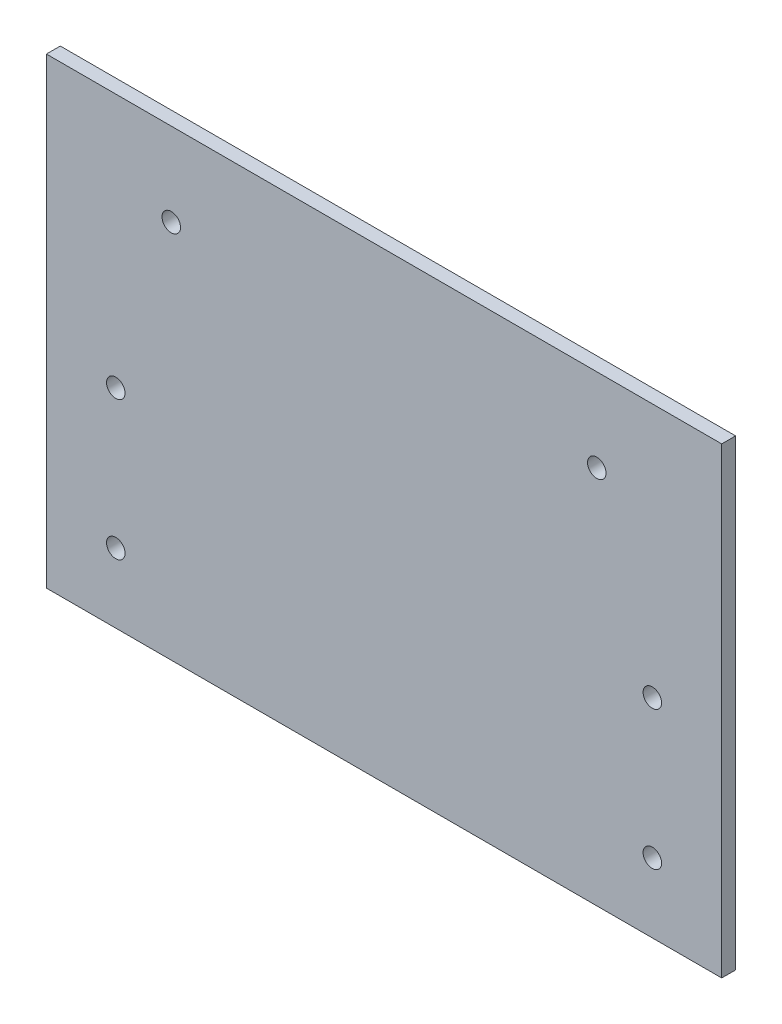
ISO-10303-21;
HEADER;
FILE_DESCRIPTION(('STEP AP214'),'2;1');
FILE_NAME('part.step','',(''),(''),'','','');
FILE_SCHEMA(('AUTOMOTIVE_DESIGN { 1 0 10303 214 1 1 1 1 }'));
ENDSEC;
DATA;
#1=APPLICATION_CONTEXT('core data for automotive mechanical design processes');
#2=APPLICATION_PROTOCOL_DEFINITION('international standard','automotive_design',2000,#1);
#3=PRODUCT_CONTEXT('',#1,'mechanical');
#4=PRODUCT('Part','Part','',(#3));
#5=PRODUCT_RELATED_PRODUCT_CATEGORY('part','',(#4));
#6=PRODUCT_DEFINITION_FORMATION('','',#4);
#7=PRODUCT_DEFINITION_CONTEXT('part definition',#1,'design');
#8=PRODUCT_DEFINITION('design','',#6,#7);
#9=PRODUCT_DEFINITION_SHAPE('','',#8);
#10=(LENGTH_UNIT() NAMED_UNIT(*) SI_UNIT(.MILLI.,.METRE.));
#11=(NAMED_UNIT(*) PLANE_ANGLE_UNIT() SI_UNIT($,.RADIAN.));
#12=(NAMED_UNIT(*) SI_UNIT($,.STERADIAN.) SOLID_ANGLE_UNIT());
#13=UNCERTAINTY_MEASURE_WITH_UNIT(LENGTH_MEASURE(1.E-05),#10,'distance_accuracy_value','');
#14=(GEOMETRIC_REPRESENTATION_CONTEXT(3) GLOBAL_UNCERTAINTY_ASSIGNED_CONTEXT((#13)) GLOBAL_UNIT_ASSIGNED_CONTEXT((#10,
#11,#12)) REPRESENTATION_CONTEXT('',''));
#15=CARTESIAN_POINT('',(0.,0.,0.));
#16=DIRECTION('',(0.,0.,1.));
#17=DIRECTION('',(1.,0.,0.));
#18=AXIS2_PLACEMENT_3D('',#15,#16,#17);
#19=CARTESIAN_POINT('',(-74.1234628329721,86.0211742752654,3.));
#20=DIRECTION('',(1.,0.,0.));
#21=DIRECTION('',(0.,1.,0.));
#22=AXIS2_PLACEMENT_3D('',#19,#20,#21);
#23=PLANE('',#22);
#24=DIRECTION('',(0.,-1.,0.));
#25=VECTOR('',#24,1.);
#26=CARTESIAN_POINT('',(-74.1234628329721,86.0211742752654,0.));
#27=LINE('',#26,#25);
#28=CARTESIAN_POINT('',(-74.1234628329721,86.0211742752654,0.));
#29=VERTEX_POINT('',#28);
#30=CARTESIAN_POINT('',(-74.1234628329721,-13.9788257247346,0.));
#31=VERTEX_POINT('',#30);
#32=EDGE_CURVE('E96',#29,#31,#27,.T.);
#33=ORIENTED_EDGE('',*,*,#32,.T.);
#34=DIRECTION('',(0.,0.,-1.));
#35=VECTOR('',#34,1.);
#36=CARTESIAN_POINT('',(-74.1234628329721,-13.9788257247346,3.));
#37=LINE('',#36,#35);
#38=CARTESIAN_POINT('',(-74.1234628329721,-13.9788257247346,3.));
#39=VERTEX_POINT('',#38);
#40=EDGE_CURVE('E11',#39,#31,#37,.T.);
#41=ORIENTED_EDGE('',*,*,#40,.F.);
#42=DIRECTION('',(0.,-1.,0.));
#43=VECTOR('',#42,1.);
#44=CARTESIAN_POINT('',(-74.1234628329721,86.0211742752654,3.));
#45=LINE('',#44,#43);
#46=CARTESIAN_POINT('',(-74.1234628329721,86.0211742752654,3.));
#47=VERTEX_POINT('',#46);
#48=EDGE_CURVE('E84',#47,#39,#45,.T.);
#49=ORIENTED_EDGE('',*,*,#48,.F.);
#50=DIRECTION('',(0.,0.,-1.));
#51=VECTOR('',#50,1.);
#52=CARTESIAN_POINT('',(-74.1234628329721,86.0211742752654,3.));
#53=LINE('',#52,#51);
#54=EDGE_CURVE('E92',#47,#29,#53,.T.);
#55=ORIENTED_EDGE('',*,*,#54,.T.);
#56=EDGE_LOOP('',(#33,#41,#49,#55));
#57=FACE_BOUND('',#56,.T.);
#58=ADVANCED_FACE('F33',(#57),#23,.F.);
#59=CARTESIAN_POINT('',(-74.1234628329721,-13.9788257247346,3.));
#60=DIRECTION('',(0.,1.,0.));
#61=DIRECTION('',(0.,0.,1.));
#62=AXIS2_PLACEMENT_3D('',#59,#60,#61);
#63=PLANE('',#62);
#64=DIRECTION('',(1.,0.,0.));
#65=VECTOR('',#64,1.);
#66=CARTESIAN_POINT('',(-74.1234628329721,-13.9788257247346,0.));
#67=LINE('',#66,#65);
#68=CARTESIAN_POINT('',(71.8765371670279,-13.9788257247346,0.));
#69=VERTEX_POINT('',#68);
#70=EDGE_CURVE('E88',#31,#69,#67,.T.);
#71=ORIENTED_EDGE('',*,*,#70,.T.);
#72=DIRECTION('',(0.,0.,-1.));
#73=VECTOR('',#72,1.);
#74=CARTESIAN_POINT('',(71.8765371670279,-13.9788257247346,3.));
#75=LINE('',#74,#73);
#76=CARTESIAN_POINT('',(71.8765371670279,-13.9788257247346,3.));
#77=VERTEX_POINT('',#76);
#78=EDGE_CURVE('E41',#77,#69,#75,.T.);
#79=ORIENTED_EDGE('',*,*,#78,.F.);
#80=DIRECTION('',(1.,0.,0.));
#81=VECTOR('',#80,1.);
#82=CARTESIAN_POINT('',(-74.1234628329721,-13.9788257247346,3.));
#83=LINE('',#82,#81);
#84=EDGE_CURVE('E79',#39,#77,#83,.T.);
#85=ORIENTED_EDGE('',*,*,#84,.F.);
#86=ORIENTED_EDGE('',*,*,#40,.T.);
#87=EDGE_LOOP('',(#71,#79,#85,#86));
#88=FACE_BOUND('',#87,.T.);
#89=ADVANCED_FACE('F87',(#88),#63,.F.);
#90=CARTESIAN_POINT('',(71.8765371670279,86.0211742752654,3.));
#91=DIRECTION('',(-1.,0.,0.));
#92=DIRECTION('',(0.,-1.,0.));
#93=AXIS2_PLACEMENT_3D('',#90,#91,#92);
#94=PLANE('',#93);
#95=DIRECTION('',(0.,1.,0.));
#96=VECTOR('',#95,1.);
#97=CARTESIAN_POINT('',(71.8765371670279,86.0211742752654,0.));
#98=LINE('',#97,#96);
#99=CARTESIAN_POINT('',(71.8765371670279,86.0211742752654,0.));
#100=VERTEX_POINT('',#99);
#101=EDGE_CURVE('E66',#69,#100,#98,.T.);
#102=ORIENTED_EDGE('',*,*,#101,.T.);
#103=DIRECTION('',(0.,0.,-1.));
#104=VECTOR('',#103,1.);
#105=CARTESIAN_POINT('',(71.8765371670279,86.0211742752654,3.));
#106=LINE('',#105,#104);
#107=CARTESIAN_POINT('',(71.8765371670279,86.0211742752654,3.));
#108=VERTEX_POINT('',#107);
#109=EDGE_CURVE('E89',#108,#100,#106,.T.);
#110=ORIENTED_EDGE('',*,*,#109,.F.);
#111=DIRECTION('',(0.,1.,0.));
#112=VECTOR('',#111,1.);
#113=CARTESIAN_POINT('',(71.8765371670279,86.0211742752654,3.));
#114=LINE('',#113,#112);
#115=EDGE_CURVE('E82',#77,#108,#114,.T.);
#116=ORIENTED_EDGE('',*,*,#115,.F.);
#117=ORIENTED_EDGE('',*,*,#78,.T.);
#118=EDGE_LOOP('',(#102,#110,#116,#117));
#119=FACE_BOUND('',#118,.T.);
#120=ADVANCED_FACE('F90',(#119),#94,.F.);
#121=CARTESIAN_POINT('',(-74.1234628329721,86.0211742752654,3.));
#122=DIRECTION('',(0.,-1.,0.));
#123=DIRECTION('',(0.,0.,-1.));
#124=AXIS2_PLACEMENT_3D('',#121,#122,#123);
#125=PLANE('',#124);
#126=DIRECTION('',(-1.,0.,0.));
#127=VECTOR('',#126,1.);
#128=CARTESIAN_POINT('',(-74.1234628329721,86.0211742752654,0.));
#129=LINE('',#128,#127);
#130=EDGE_CURVE('E72',#100,#29,#129,.T.);
#131=ORIENTED_EDGE('',*,*,#130,.T.);
#132=ORIENTED_EDGE('',*,*,#54,.F.);
#133=DIRECTION('',(-1.,0.,0.));
#134=VECTOR('',#133,1.);
#135=CARTESIAN_POINT('',(-74.1234628329721,86.0211742752654,3.));
#136=LINE('',#135,#134);
#137=EDGE_CURVE('E49',#108,#47,#136,.T.);
#138=ORIENTED_EDGE('',*,*,#137,.F.);
#139=ORIENTED_EDGE('',*,*,#109,.T.);
#140=EDGE_LOOP('',(#131,#132,#138,#139));
#141=FACE_BOUND('',#140,.T.);
#142=ADVANCED_FACE('F104',(#141),#125,.F.);
#143=CARTESIAN_POINT('',(-74.1234628329721,-13.9788257247346,3.));
#144=DIRECTION('',(0.,0.,1.));
#145=DIRECTION('',(1.,0.,0.));
#146=AXIS2_PLACEMENT_3D('',#143,#144,#145);
#147=PLANE('',#146);
#148=CARTESIAN_POINT('',(-47.1242286311053,68.0398562855657,3.));
#149=DIRECTION('',(0.,0.,-1.));
#150=DIRECTION('',(-1.,0.,0.));
#151=AXIS2_PLACEMENT_3D('',#148,#149,#150);
#152=CIRCLE('',#151,2.);
#153=CARTESIAN_POINT('',(-49.1242286311053,68.0398562855657,3.));
#154=VERTEX_POINT('',#153);
#155=EDGE_CURVE('E137',#154,#154,#152,.T.);
#156=ORIENTED_EDGE('',*,*,#155,.T.);
#157=EDGE_LOOP('',(#156));
#158=FACE_BOUND('',#157,.T.);
#159=CARTESIAN_POINT('',(44.8668285565645,68.0398562855657,3.));
#160=DIRECTION('',(0.,0.,-1.));
#161=DIRECTION('',(-1.,0.,0.));
#162=AXIS2_PLACEMENT_3D('',#159,#160,#161);
#163=CIRCLE('',#162,2.);
#164=CARTESIAN_POINT('',(42.8668285565645,68.0398562855657,3.));
#165=VERTEX_POINT('',#164);
#166=EDGE_CURVE('E131',#165,#165,#163,.T.);
#167=ORIENTED_EDGE('',*,*,#166,.T.);
#168=EDGE_LOOP('',(#167));
#169=FACE_BOUND('',#168,.T.);
#170=CARTESIAN_POINT('',(-59.1234628329721,31.0211742752654,3.));
#171=DIRECTION('',(0.,0.,-1.));
#172=DIRECTION('',(-1.,0.,0.));
#173=AXIS2_PLACEMENT_3D('',#170,#171,#172);
#174=CIRCLE('',#173,2.);
#175=CARTESIAN_POINT('',(-61.1234628329721,31.0211742752654,3.));
#176=VERTEX_POINT('',#175);
#177=EDGE_CURVE('E125',#176,#176,#174,.T.);
#178=ORIENTED_EDGE('',*,*,#177,.T.);
#179=EDGE_LOOP('',(#178));
#180=FACE_BOUND('',#179,.T.);
#181=CARTESIAN_POINT('',(56.8765371670279,31.0211742752654,3.));
#182=DIRECTION('',(0.,0.,-1.));
#183=DIRECTION('',(-1.,0.,0.));
#184=AXIS2_PLACEMENT_3D('',#181,#182,#183);
#185=CIRCLE('',#184,2.);
#186=CARTESIAN_POINT('',(54.8765371670279,31.0211742752654,3.));
#187=VERTEX_POINT('',#186);
#188=EDGE_CURVE('E119',#187,#187,#185,.T.);
#189=ORIENTED_EDGE('',*,*,#188,.T.);
#190=EDGE_LOOP('',(#189));
#191=FACE_BOUND('',#190,.T.);
#192=CARTESIAN_POINT('',(56.8765371670278,1.02117427526537,3.));
#193=DIRECTION('',(0.,0.,-1.));
#194=DIRECTION('',(-1.,0.,0.));
#195=AXIS2_PLACEMENT_3D('',#192,#193,#194);
#196=CIRCLE('',#195,2.);
#197=CARTESIAN_POINT('',(54.8765371670278,1.02117427526537,3.));
#198=VERTEX_POINT('',#197);
#199=EDGE_CURVE('E113',#198,#198,#196,.T.);
#200=ORIENTED_EDGE('',*,*,#199,.T.);
#201=EDGE_LOOP('',(#200));
#202=FACE_BOUND('',#201,.T.);
#203=CARTESIAN_POINT('',(-59.1234628329721,1.02117427526536,3.));
#204=DIRECTION('',(0.,0.,-1.));
#205=DIRECTION('',(-1.,0.,0.));
#206=AXIS2_PLACEMENT_3D('',#203,#204,#205);
#207=CIRCLE('',#206,2.);
#208=CARTESIAN_POINT('',(-61.1234628329721,1.02117427526536,3.));
#209=VERTEX_POINT('',#208);
#210=EDGE_CURVE('E99',#209,#209,#207,.T.);
#211=ORIENTED_EDGE('',*,*,#210,.T.);
#212=EDGE_LOOP('',(#211));
#213=FACE_BOUND('',#212,.T.);
#214=ORIENTED_EDGE('',*,*,#48,.T.);
#215=ORIENTED_EDGE('',*,*,#84,.T.);
#216=ORIENTED_EDGE('',*,*,#115,.T.);
#217=ORIENTED_EDGE('',*,*,#137,.T.);
#218=EDGE_LOOP('',(#214,#215,#216,#217));
#219=FACE_BOUND('',#218,.T.);
#220=ADVANCED_FACE('F80',(#158,#169,#180,#191,#202,#213,#219),#147,.T.);
#221=CARTESIAN_POINT('',(-74.1234628329721,-13.9788257247346,0.));
#222=DIRECTION('',(0.,0.,1.));
#223=DIRECTION('',(1.,0.,0.));
#224=AXIS2_PLACEMENT_3D('',#221,#222,#223);
#225=PLANE('',#224);
#226=CARTESIAN_POINT('',(-47.1242286311053,68.0398562855657,0.));
#227=DIRECTION('',(0.,0.,-1.));
#228=DIRECTION('',(-1.,0.,0.));
#229=AXIS2_PLACEMENT_3D('',#226,#227,#228);
#230=CIRCLE('',#229,2.);
#231=CARTESIAN_POINT('',(-49.1242286311053,68.0398562855657,0.));
#232=VERTEX_POINT('',#231);
#233=EDGE_CURVE('E140',#232,#232,#230,.T.);
#234=ORIENTED_EDGE('',*,*,#233,.F.);
#235=EDGE_LOOP('',(#234));
#236=FACE_BOUND('',#235,.T.);
#237=CARTESIAN_POINT('',(44.8668285565645,68.0398562855657,0.));
#238=DIRECTION('',(0.,0.,-1.));
#239=DIRECTION('',(-1.,0.,0.));
#240=AXIS2_PLACEMENT_3D('',#237,#238,#239);
#241=CIRCLE('',#240,2.);
#242=CARTESIAN_POINT('',(42.8668285565645,68.0398562855657,0.));
#243=VERTEX_POINT('',#242);
#244=EDGE_CURVE('E134',#243,#243,#241,.T.);
#245=ORIENTED_EDGE('',*,*,#244,.F.);
#246=EDGE_LOOP('',(#245));
#247=FACE_BOUND('',#246,.T.);
#248=CARTESIAN_POINT('',(-59.1234628329721,31.0211742752654,0.));
#249=DIRECTION('',(0.,0.,-1.));
#250=DIRECTION('',(-1.,0.,0.));
#251=AXIS2_PLACEMENT_3D('',#248,#249,#250);
#252=CIRCLE('',#251,2.);
#253=CARTESIAN_POINT('',(-61.1234628329721,31.0211742752654,0.));
#254=VERTEX_POINT('',#253);
#255=EDGE_CURVE('E128',#254,#254,#252,.T.);
#256=ORIENTED_EDGE('',*,*,#255,.F.);
#257=EDGE_LOOP('',(#256));
#258=FACE_BOUND('',#257,.T.);
#259=CARTESIAN_POINT('',(56.8765371670279,31.0211742752654,0.));
#260=DIRECTION('',(0.,0.,-1.));
#261=DIRECTION('',(-1.,0.,0.));
#262=AXIS2_PLACEMENT_3D('',#259,#260,#261);
#263=CIRCLE('',#262,2.);
#264=CARTESIAN_POINT('',(54.8765371670279,31.0211742752654,0.));
#265=VERTEX_POINT('',#264);
#266=EDGE_CURVE('E122',#265,#265,#263,.T.);
#267=ORIENTED_EDGE('',*,*,#266,.F.);
#268=EDGE_LOOP('',(#267));
#269=FACE_BOUND('',#268,.T.);
#270=CARTESIAN_POINT('',(56.8765371670278,1.02117427526537,0.));
#271=DIRECTION('',(0.,0.,-1.));
#272=DIRECTION('',(-1.,0.,0.));
#273=AXIS2_PLACEMENT_3D('',#270,#271,#272);
#274=CIRCLE('',#273,2.);
#275=CARTESIAN_POINT('',(54.8765371670278,1.02117427526537,0.));
#276=VERTEX_POINT('',#275);
#277=EDGE_CURVE('E116',#276,#276,#274,.T.);
#278=ORIENTED_EDGE('',*,*,#277,.F.);
#279=EDGE_LOOP('',(#278));
#280=FACE_BOUND('',#279,.T.);
#281=CARTESIAN_POINT('',(-59.1234628329721,1.02117427526536,0.));
#282=DIRECTION('',(0.,0.,-1.));
#283=DIRECTION('',(-1.,0.,0.));
#284=AXIS2_PLACEMENT_3D('',#281,#282,#283);
#285=CIRCLE('',#284,2.);
#286=CARTESIAN_POINT('',(-61.1234628329721,1.02117427526536,0.));
#287=VERTEX_POINT('',#286);
#288=EDGE_CURVE('E110',#287,#287,#285,.T.);
#289=ORIENTED_EDGE('',*,*,#288,.F.);
#290=EDGE_LOOP('',(#289));
#291=FACE_BOUND('',#290,.T.);
#292=ORIENTED_EDGE('',*,*,#32,.F.);
#293=ORIENTED_EDGE('',*,*,#130,.F.);
#294=ORIENTED_EDGE('',*,*,#101,.F.);
#295=ORIENTED_EDGE('',*,*,#70,.F.);
#296=EDGE_LOOP('',(#292,#293,#294,#295));
#297=FACE_BOUND('',#296,.T.);
#298=ADVANCED_FACE('F107',(#236,#247,#258,#269,#280,#291,#297),#225,.F.);
#299=CARTESIAN_POINT('',(-59.1234628329721,1.02117427526536,3.));
#300=DIRECTION('',(0.,0.,-1.));
#301=DIRECTION('',(-1.,0.,0.));
#302=AXIS2_PLACEMENT_3D('',#299,#300,#301);
#303=CYLINDRICAL_SURFACE('',#302,2.);
#304=ORIENTED_EDGE('',*,*,#210,.F.);
#305=EDGE_LOOP('',(#304));
#306=FACE_BOUND('',#305,.T.);
#307=ORIENTED_EDGE('',*,*,#288,.T.);
#308=EDGE_LOOP('',(#307));
#309=FACE_BOUND('',#308,.T.);
#310=ADVANCED_FACE('F157',(#306,#309),#303,.F.);
#311=CARTESIAN_POINT('',(56.8765371670278,1.02117427526537,3.));
#312=DIRECTION('',(0.,0.,-1.));
#313=DIRECTION('',(-1.,0.,0.));
#314=AXIS2_PLACEMENT_3D('',#311,#312,#313);
#315=CYLINDRICAL_SURFACE('',#314,2.);
#316=ORIENTED_EDGE('',*,*,#199,.F.);
#317=EDGE_LOOP('',(#316));
#318=FACE_BOUND('',#317,.T.);
#319=ORIENTED_EDGE('',*,*,#277,.T.);
#320=EDGE_LOOP('',(#319));
#321=FACE_BOUND('',#320,.T.);
#322=ADVANCED_FACE('F170',(#318,#321),#315,.F.);
#323=CARTESIAN_POINT('',(56.8765371670279,31.0211742752654,3.));
#324=DIRECTION('',(0.,0.,-1.));
#325=DIRECTION('',(-1.,0.,0.));
#326=AXIS2_PLACEMENT_3D('',#323,#324,#325);
#327=CYLINDRICAL_SURFACE('',#326,2.);
#328=ORIENTED_EDGE('',*,*,#188,.F.);
#329=EDGE_LOOP('',(#328));
#330=FACE_BOUND('',#329,.T.);
#331=ORIENTED_EDGE('',*,*,#266,.T.);
#332=EDGE_LOOP('',(#331));
#333=FACE_BOUND('',#332,.T.);
#334=ADVANCED_FACE('F177',(#330,#333),#327,.F.);
#335=CARTESIAN_POINT('',(-59.1234628329721,31.0211742752654,3.));
#336=DIRECTION('',(0.,0.,-1.));
#337=DIRECTION('',(-1.,0.,0.));
#338=AXIS2_PLACEMENT_3D('',#335,#336,#337);
#339=CYLINDRICAL_SURFACE('',#338,2.);
#340=ORIENTED_EDGE('',*,*,#177,.F.);
#341=EDGE_LOOP('',(#340));
#342=FACE_BOUND('',#341,.T.);
#343=ORIENTED_EDGE('',*,*,#255,.T.);
#344=EDGE_LOOP('',(#343));
#345=FACE_BOUND('',#344,.T.);
#346=ADVANCED_FACE('F198',(#342,#345),#339,.F.);
#347=CARTESIAN_POINT('',(44.8668285565645,68.0398562855657,3.));
#348=DIRECTION('',(0.,0.,-1.));
#349=DIRECTION('',(-1.,0.,0.));
#350=AXIS2_PLACEMENT_3D('',#347,#348,#349);
#351=CYLINDRICAL_SURFACE('',#350,2.);
#352=ORIENTED_EDGE('',*,*,#166,.F.);
#353=EDGE_LOOP('',(#352));
#354=FACE_BOUND('',#353,.T.);
#355=ORIENTED_EDGE('',*,*,#244,.T.);
#356=EDGE_LOOP('',(#355));
#357=FACE_BOUND('',#356,.T.);
#358=ADVANCED_FACE('F151',(#354,#357),#351,.F.);
#359=CARTESIAN_POINT('',(-47.1242286311053,68.0398562855657,3.));
#360=DIRECTION('',(0.,0.,-1.));
#361=DIRECTION('',(-1.,0.,0.));
#362=AXIS2_PLACEMENT_3D('',#359,#360,#361);
#363=CYLINDRICAL_SURFACE('',#362,2.);
#364=ORIENTED_EDGE('',*,*,#155,.F.);
#365=EDGE_LOOP('',(#364));
#366=FACE_BOUND('',#365,.T.);
#367=ORIENTED_EDGE('',*,*,#233,.T.);
#368=EDGE_LOOP('',(#367));
#369=FACE_BOUND('',#368,.T.);
#370=ADVANCED_FACE('F148',(#366,#369),#363,.F.);
#371=CLOSED_SHELL('',(#58,#89,#120,#142,#220,#298,#310,#322,#334,#346,#358,#370));
#372=MANIFOLD_SOLID_BREP('B2',#371);
#373=ADVANCED_BREP_SHAPE_REPRESENTATION('',(#18,#372),#14);
#374=SHAPE_DEFINITION_REPRESENTATION(#9,#373);
ENDSEC;
END-ISO-10303-21;
